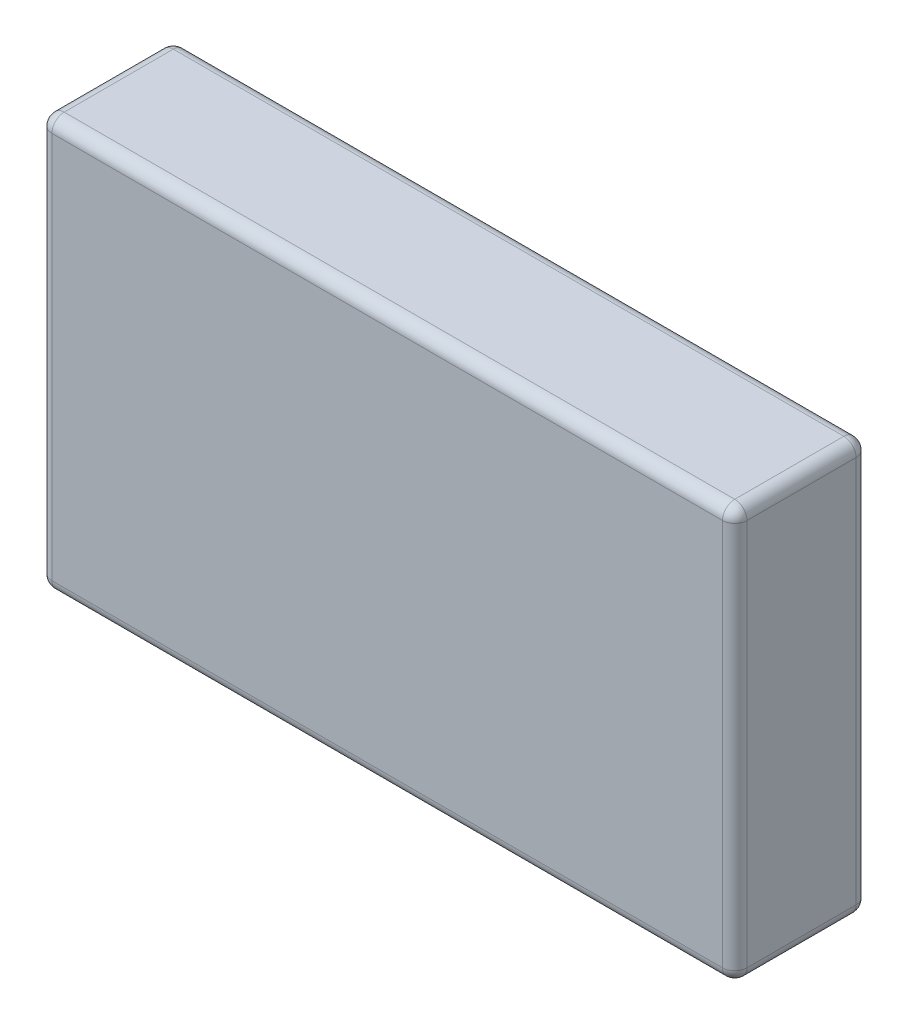
ISO-10303-21;
HEADER;
FILE_DESCRIPTION(('STEP AP214'),'2;1');
FILE_NAME('part.step','',(''),(''),'','','');
FILE_SCHEMA(('AUTOMOTIVE_DESIGN { 1 0 10303 214 1 1 1 1 }'));
ENDSEC;
DATA;
#1=APPLICATION_CONTEXT('core data for automotive mechanical design processes');
#2=APPLICATION_PROTOCOL_DEFINITION('international standard','automotive_design',2000,#1);
#3=PRODUCT_CONTEXT('',#1,'mechanical');
#4=PRODUCT('Part','Part','',(#3));
#5=PRODUCT_RELATED_PRODUCT_CATEGORY('part','',(#4));
#6=PRODUCT_DEFINITION_FORMATION('','',#4);
#7=PRODUCT_DEFINITION_CONTEXT('part definition',#1,'design');
#8=PRODUCT_DEFINITION('design','',#6,#7);
#9=PRODUCT_DEFINITION_SHAPE('','',#8);
#10=(LENGTH_UNIT() NAMED_UNIT(*) SI_UNIT(.MILLI.,.METRE.));
#11=(NAMED_UNIT(*) PLANE_ANGLE_UNIT() SI_UNIT($,.RADIAN.));
#12=(NAMED_UNIT(*) SI_UNIT($,.STERADIAN.) SOLID_ANGLE_UNIT());
#13=UNCERTAINTY_MEASURE_WITH_UNIT(LENGTH_MEASURE(1.E-05),#10,'distance_accuracy_value','');
#14=(GEOMETRIC_REPRESENTATION_CONTEXT(3) GLOBAL_UNCERTAINTY_ASSIGNED_CONTEXT((#13)) GLOBAL_UNIT_ASSIGNED_CONTEXT((#10,
#11,#12)) REPRESENTATION_CONTEXT('',''));
#15=CARTESIAN_POINT('',(0.,0.,0.));
#16=DIRECTION('',(0.,0.,1.));
#17=DIRECTION('',(1.,0.,0.));
#18=AXIS2_PLACEMENT_3D('',#15,#16,#17);
#19=CARTESIAN_POINT('',(-72.009,0.,-13.843));
#20=DIRECTION('',(-1.,0.,0.));
#21=DIRECTION('',(0.,1.,0.));
#22=AXIS2_PLACEMENT_3D('',#19,#20,#21);
#23=PLANE('',#22);
#24=DIRECTION('',(0.,-1.,0.));
#25=VECTOR('',#24,1.);
#26=CARTESIAN_POINT('',(-72.009,0.,11.303));
#27=LINE('',#26,#25);
#28=CARTESIAN_POINT('',(-72.009,82.804,11.303));
#29=VERTEX_POINT('',#28);
#30=CARTESIAN_POINT('',(-72.009,2.54,11.303));
#31=VERTEX_POINT('',#30);
#32=EDGE_CURVE('E169',#29,#31,#27,.T.);
#33=ORIENTED_EDGE('',*,*,#32,.F.);
#34=DIRECTION('',(0.,0.,1.));
#35=VECTOR('',#34,1.);
#36=CARTESIAN_POINT('',(-72.009,82.804,-6.9215));
#37=LINE('',#36,#35);
#38=CARTESIAN_POINT('',(-72.009,82.804,-11.303));
#39=VERTEX_POINT('',#38);
#40=EDGE_CURVE('E200',#39,#29,#37,.T.);
#41=ORIENTED_EDGE('',*,*,#40,.F.);
#42=DIRECTION('',(0.,1.,0.));
#43=VECTOR('',#42,1.);
#44=CARTESIAN_POINT('',(-72.009,0.,-11.303));
#45=LINE('',#44,#43);
#46=CARTESIAN_POINT('',(-72.009,2.54,-11.303));
#47=VERTEX_POINT('',#46);
#48=EDGE_CURVE('E20',#47,#39,#45,.T.);
#49=ORIENTED_EDGE('',*,*,#48,.F.);
#50=DIRECTION('',(0.,0.,-1.));
#51=VECTOR('',#50,1.);
#52=CARTESIAN_POINT('',(-72.009,2.54,-6.9215));
#53=LINE('',#52,#51);
#54=EDGE_CURVE('E161',#31,#47,#53,.T.);
#55=ORIENTED_EDGE('',*,*,#54,.F.);
#56=EDGE_LOOP('',(#33,#41,#49,#55));
#57=FACE_BOUND('',#56,.T.);
#58=ADVANCED_FACE('F16',(#57),#23,.T.);
#59=CARTESIAN_POINT('',(0.,85.344,0.));
#60=DIRECTION('',(0.,1.,0.));
#61=DIRECTION('',(1.,0.,0.));
#62=AXIS2_PLACEMENT_3D('',#59,#60,#61);
#63=PLANE('',#62);
#64=DIRECTION('',(0.,0.,1.));
#65=VECTOR('',#64,1.);
#66=CARTESIAN_POINT('',(69.469,85.344,6.9215));
#67=LINE('',#66,#65);
#68=CARTESIAN_POINT('',(69.469,85.344,-11.303));
#69=VERTEX_POINT('',#68);
#70=CARTESIAN_POINT('',(69.469,85.344,11.303));
#71=VERTEX_POINT('',#70);
#72=EDGE_CURVE('E254',#69,#71,#67,.T.);
#73=ORIENTED_EDGE('',*,*,#72,.F.);
#74=DIRECTION('',(1.,0.,0.));
#75=VECTOR('',#74,1.);
#76=CARTESIAN_POINT('',(36.0045,85.344,-11.303));
#77=LINE('',#76,#75);
#78=CARTESIAN_POINT('',(-69.469,85.344,-11.303));
#79=VERTEX_POINT('',#78);
#80=EDGE_CURVE('E123',#79,#69,#77,.T.);
#81=ORIENTED_EDGE('',*,*,#80,.F.);
#82=DIRECTION('',(0.,0.,-1.));
#83=VECTOR('',#82,1.);
#84=CARTESIAN_POINT('',(-69.469,85.344,-6.9215));
#85=LINE('',#84,#83);
#86=CARTESIAN_POINT('',(-69.469,85.344,11.303));
#87=VERTEX_POINT('',#86);
#88=EDGE_CURVE('E196',#87,#79,#85,.T.);
#89=ORIENTED_EDGE('',*,*,#88,.F.);
#90=DIRECTION('',(-1.,0.,0.));
#91=VECTOR('',#90,1.);
#92=CARTESIAN_POINT('',(-36.0045,85.344,11.303));
#93=LINE('',#92,#91);
#94=EDGE_CURVE('E188',#71,#87,#93,.T.);
#95=ORIENTED_EDGE('',*,*,#94,.F.);
#96=EDGE_LOOP('',(#73,#81,#89,#95));
#97=FACE_BOUND('',#96,.T.);
#98=ADVANCED_FACE('F355',(#97),#63,.T.);
#99=CARTESIAN_POINT('',(72.009,0.,13.843));
#100=DIRECTION('',(1.,0.,0.));
#101=DIRECTION('',(0.,0.,1.));
#102=AXIS2_PLACEMENT_3D('',#99,#100,#101);
#103=PLANE('',#102);
#104=DIRECTION('',(0.,1.,0.));
#105=VECTOR('',#104,1.);
#106=CARTESIAN_POINT('',(72.009,0.,11.303));
#107=LINE('',#106,#105);
#108=CARTESIAN_POINT('',(72.009,2.54,11.303));
#109=VERTEX_POINT('',#108);
#110=CARTESIAN_POINT('',(72.009,82.804,11.303));
#111=VERTEX_POINT('',#110);
#112=EDGE_CURVE('E258',#109,#111,#107,.T.);
#113=ORIENTED_EDGE('',*,*,#112,.F.);
#114=DIRECTION('',(0.,0.,1.));
#115=VECTOR('',#114,1.);
#116=CARTESIAN_POINT('',(72.009,2.54,6.9215));
#117=LINE('',#116,#115);
#118=CARTESIAN_POINT('',(72.009,2.54,-11.303));
#119=VERTEX_POINT('',#118);
#120=EDGE_CURVE('E10',#119,#109,#117,.T.);
#121=ORIENTED_EDGE('',*,*,#120,.F.);
#122=DIRECTION('',(0.,-1.,0.));
#123=VECTOR('',#122,1.);
#124=CARTESIAN_POINT('',(72.009,0.,-11.303));
#125=LINE('',#124,#123);
#126=CARTESIAN_POINT('',(72.009,82.804,-11.303));
#127=VERTEX_POINT('',#126);
#128=EDGE_CURVE('E235',#127,#119,#125,.T.);
#129=ORIENTED_EDGE('',*,*,#128,.F.);
#130=DIRECTION('',(0.,0.,-1.));
#131=VECTOR('',#130,1.);
#132=CARTESIAN_POINT('',(72.009,82.804,6.9215));
#133=LINE('',#132,#131);
#134=EDGE_CURVE('E257',#111,#127,#133,.T.);
#135=ORIENTED_EDGE('',*,*,#134,.F.);
#136=EDGE_LOOP('',(#113,#121,#129,#135));
#137=FACE_BOUND('',#136,.T.);
#138=ADVANCED_FACE('F18',(#137),#103,.T.);
#139=CARTESIAN_POINT('',(0.,0.,0.));
#140=DIRECTION('',(0.,1.,0.));
#141=DIRECTION('',(1.,0.,0.));
#142=AXIS2_PLACEMENT_3D('',#139,#140,#141);
#143=PLANE('',#142);
#144=DIRECTION('',(1.,0.,0.));
#145=VECTOR('',#144,1.);
#146=CARTESIAN_POINT('',(-36.0045,0.,11.303));
#147=LINE('',#146,#145);
#148=CARTESIAN_POINT('',(-69.469,0.,11.303));
#149=VERTEX_POINT('',#148);
#150=CARTESIAN_POINT('',(69.469,0.,11.303));
#151=VERTEX_POINT('',#150);
#152=EDGE_CURVE('E157',#149,#151,#147,.T.);
#153=ORIENTED_EDGE('',*,*,#152,.F.);
#154=DIRECTION('',(0.,0.,1.));
#155=VECTOR('',#154,1.);
#156=CARTESIAN_POINT('',(-69.469,0.,-6.9215));
#157=LINE('',#156,#155);
#158=CARTESIAN_POINT('',(-69.469,0.,-11.303));
#159=VERTEX_POINT('',#158);
#160=EDGE_CURVE('E122',#159,#149,#157,.T.);
#161=ORIENTED_EDGE('',*,*,#160,.F.);
#162=DIRECTION('',(-1.,0.,0.));
#163=VECTOR('',#162,1.);
#164=CARTESIAN_POINT('',(36.0045,0.,-11.303));
#165=LINE('',#164,#163);
#166=CARTESIAN_POINT('',(69.469,0.,-11.303));
#167=VERTEX_POINT('',#166);
#168=EDGE_CURVE('E174',#167,#159,#165,.T.);
#169=ORIENTED_EDGE('',*,*,#168,.F.);
#170=DIRECTION('',(0.,0.,-1.));
#171=VECTOR('',#170,1.);
#172=CARTESIAN_POINT('',(69.469,0.,6.9215));
#173=LINE('',#172,#171);
#174=EDGE_CURVE('E27',#151,#167,#173,.T.);
#175=ORIENTED_EDGE('',*,*,#174,.F.);
#176=EDGE_LOOP('',(#153,#161,#169,#175));
#177=FACE_BOUND('',#176,.T.);
#178=ADVANCED_FACE('F403',(#177),#143,.F.);
#179=CARTESIAN_POINT('',(-72.009,0.,13.843));
#180=DIRECTION('',(0.,0.,1.));
#181=DIRECTION('',(1.,0.,0.));
#182=AXIS2_PLACEMENT_3D('',#179,#180,#181);
#183=PLANE('',#182);
#184=DIRECTION('',(-1.,0.,0.));
#185=VECTOR('',#184,1.);
#186=CARTESIAN_POINT('',(-36.0045,2.54,13.843));
#187=LINE('',#186,#185);
#188=CARTESIAN_POINT('',(69.469,2.54,13.843));
#189=VERTEX_POINT('',#188);
#190=CARTESIAN_POINT('',(-69.469,2.54,13.843));
#191=VERTEX_POINT('',#190);
#192=EDGE_CURVE('E150',#189,#191,#187,.T.);
#193=ORIENTED_EDGE('',*,*,#192,.F.);
#194=DIRECTION('',(0.,-1.,0.));
#195=VECTOR('',#194,1.);
#196=CARTESIAN_POINT('',(69.469,0.,13.843));
#197=LINE('',#196,#195);
#198=CARTESIAN_POINT('',(69.469,82.804,13.843));
#199=VERTEX_POINT('',#198);
#200=EDGE_CURVE('E246',#199,#189,#197,.T.);
#201=ORIENTED_EDGE('',*,*,#200,.F.);
#202=DIRECTION('',(1.,0.,0.));
#203=VECTOR('',#202,1.);
#204=CARTESIAN_POINT('',(-36.0045,82.804,13.843));
#205=LINE('',#204,#203);
#206=CARTESIAN_POINT('',(-69.469,82.804,13.843));
#207=VERTEX_POINT('',#206);
#208=EDGE_CURVE('E41',#207,#199,#205,.T.);
#209=ORIENTED_EDGE('',*,*,#208,.F.);
#210=DIRECTION('',(0.,1.,0.));
#211=VECTOR('',#210,1.);
#212=CARTESIAN_POINT('',(-69.469,0.,13.843));
#213=LINE('',#212,#211);
#214=EDGE_CURVE('E185',#191,#207,#213,.T.);
#215=ORIENTED_EDGE('',*,*,#214,.F.);
#216=EDGE_LOOP('',(#193,#201,#209,#215));
#217=FACE_BOUND('',#216,.T.);
#218=ADVANCED_FACE('F479',(#217),#183,.T.);
#219=CARTESIAN_POINT('',(72.009,0.,-13.843));
#220=DIRECTION('',(0.,0.,-1.));
#221=DIRECTION('',(0.,-1.,0.));
#222=AXIS2_PLACEMENT_3D('',#219,#220,#221);
#223=PLANE('',#222);
#224=DIRECTION('',(1.,0.,0.));
#225=VECTOR('',#224,1.);
#226=CARTESIAN_POINT('',(36.0045,2.54,-13.843));
#227=LINE('',#226,#225);
#228=CARTESIAN_POINT('',(-69.469,2.54,-13.843));
#229=VERTEX_POINT('',#228);
#230=CARTESIAN_POINT('',(69.469,2.54,-13.843));
#231=VERTEX_POINT('',#230);
#232=EDGE_CURVE('E131',#229,#231,#227,.T.);
#233=ORIENTED_EDGE('',*,*,#232,.F.);
#234=DIRECTION('',(0.,-1.,0.));
#235=VECTOR('',#234,1.);
#236=CARTESIAN_POINT('',(-69.469,0.,-13.843));
#237=LINE('',#236,#235);
#238=CARTESIAN_POINT('',(-69.469,82.804,-13.843));
#239=VERTEX_POINT('',#238);
#240=EDGE_CURVE('E127',#239,#229,#237,.T.);
#241=ORIENTED_EDGE('',*,*,#240,.F.);
#242=DIRECTION('',(-1.,0.,0.));
#243=VECTOR('',#242,1.);
#244=CARTESIAN_POINT('',(36.0045,82.804,-13.843));
#245=LINE('',#244,#243);
#246=CARTESIAN_POINT('',(69.469,82.804,-13.843));
#247=VERTEX_POINT('',#246);
#248=EDGE_CURVE('E110',#247,#239,#245,.T.);
#249=ORIENTED_EDGE('',*,*,#248,.F.);
#250=DIRECTION('',(0.,1.,0.));
#251=VECTOR('',#250,1.);
#252=CARTESIAN_POINT('',(69.469,0.,-13.843));
#253=LINE('',#252,#251);
#254=EDGE_CURVE('E238',#231,#247,#253,.T.);
#255=ORIENTED_EDGE('',*,*,#254,.F.);
#256=EDGE_LOOP('',(#233,#241,#249,#255));
#257=FACE_BOUND('',#256,.T.);
#258=ADVANCED_FACE('F129',(#257),#223,.T.);
#259=CARTESIAN_POINT('',(69.469,2.54,6.9215));
#260=DIRECTION('',(0.,0.,1.));
#261=DIRECTION('',(0.707106781186549,-0.707106781186546,0.));
#262=AXIS2_PLACEMENT_3D('',#259,#260,#261);
#263=CYLINDRICAL_SURFACE('',#262,2.54);
#264=CARTESIAN_POINT('',(69.469,2.54,11.303));
#265=DIRECTION('',(0.,0.,-1.));
#266=DIRECTION('',(1.,0.,0.));
#267=AXIS2_PLACEMENT_3D('',#264,#265,#266);
#268=CIRCLE('',#267,2.54);
#269=EDGE_CURVE('E205',#109,#151,#268,.T.);
#270=ORIENTED_EDGE('',*,*,#269,.T.);
#271=ORIENTED_EDGE('',*,*,#174,.T.);
#272=CARTESIAN_POINT('',(69.469,2.54,-11.303));
#273=DIRECTION('',(0.,0.,1.));
#274=DIRECTION('',(0.,-1.,0.));
#275=AXIS2_PLACEMENT_3D('',#272,#273,#274);
#276=CIRCLE('',#275,2.54);
#277=EDGE_CURVE('E247',#167,#119,#276,.T.);
#278=ORIENTED_EDGE('',*,*,#277,.T.);
#279=ORIENTED_EDGE('',*,*,#120,.T.);
#280=EDGE_LOOP('',(#270,#271,#278,#279));
#281=FACE_BOUND('',#280,.T.);
#282=ADVANCED_FACE('F398',(#281),#263,.T.);
#283=CARTESIAN_POINT('',(-69.469,2.54,-6.9215));
#284=DIRECTION('',(0.,0.,-1.));
#285=DIRECTION('',(-0.707106781186549,-0.707106781186546,0.));
#286=AXIS2_PLACEMENT_3D('',#283,#284,#285);
#287=CYLINDRICAL_SURFACE('',#286,2.54);
#288=CARTESIAN_POINT('',(-69.469,2.54,-11.303));
#289=DIRECTION('',(0.,0.,1.));
#290=DIRECTION('',(-1.,0.,0.));
#291=AXIS2_PLACEMENT_3D('',#288,#289,#290);
#292=CIRCLE('',#291,2.54);
#293=EDGE_CURVE('E231',#47,#159,#292,.T.);
#294=ORIENTED_EDGE('',*,*,#293,.T.);
#295=ORIENTED_EDGE('',*,*,#160,.T.);
#296=CARTESIAN_POINT('',(-69.469,2.54,11.303));
#297=DIRECTION('',(0.,0.,-1.));
#298=DIRECTION('',(0.,-1.,0.));
#299=AXIS2_PLACEMENT_3D('',#296,#297,#298);
#300=CIRCLE('',#299,2.54);
#301=EDGE_CURVE('E227',#149,#31,#300,.T.);
#302=ORIENTED_EDGE('',*,*,#301,.T.);
#303=ORIENTED_EDGE('',*,*,#54,.T.);
#304=EDGE_LOOP('',(#294,#295,#302,#303));
#305=FACE_BOUND('',#304,.T.);
#306=ADVANCED_FACE('F409',(#305),#287,.T.);
#307=CARTESIAN_POINT('',(36.0045,82.804,-11.303));
#308=DIRECTION('',(-1.,0.,0.));
#309=DIRECTION('',(0.,0.707106781186544,-0.707106781186551));
#310=AXIS2_PLACEMENT_3D('',#307,#308,#309);
#311=CYLINDRICAL_SURFACE('',#310,2.54);
#312=CARTESIAN_POINT('',(-69.469,82.804,-11.303));
#313=DIRECTION('',(1.,0.,0.));
#314=DIRECTION('',(0.,0.,-1.));
#315=AXIS2_PLACEMENT_3D('',#312,#313,#314);
#316=CIRCLE('',#315,2.54);
#317=EDGE_CURVE('E115',#239,#79,#316,.T.);
#318=ORIENTED_EDGE('',*,*,#317,.T.);
#319=ORIENTED_EDGE('',*,*,#80,.T.);
#320=CARTESIAN_POINT('',(69.469,82.804,-11.303));
#321=DIRECTION('',(-1.,0.,0.));
#322=DIRECTION('',(0.,1.,0.));
#323=AXIS2_PLACEMENT_3D('',#320,#321,#322);
#324=CIRCLE('',#323,2.54);
#325=EDGE_CURVE('E117',#69,#247,#324,.T.);
#326=ORIENTED_EDGE('',*,*,#325,.T.);
#327=ORIENTED_EDGE('',*,*,#248,.T.);
#328=EDGE_LOOP('',(#318,#319,#326,#327));
#329=FACE_BOUND('',#328,.T.);
#330=ADVANCED_FACE('F112',(#329),#311,.T.);
#331=CARTESIAN_POINT('',(-69.469,82.804,-6.9215));
#332=DIRECTION('',(0.,0.,1.));
#333=DIRECTION('',(-0.707106781186552,0.707106781186543,0.));
#334=AXIS2_PLACEMENT_3D('',#331,#332,#333);
#335=CYLINDRICAL_SURFACE('',#334,2.54);
#336=CARTESIAN_POINT('',(-69.469,82.804,11.303));
#337=DIRECTION('',(0.,0.,-1.));
#338=DIRECTION('',(-1.,0.,0.));
#339=AXIS2_PLACEMENT_3D('',#336,#337,#338);
#340=CIRCLE('',#339,2.54);
#341=EDGE_CURVE('E266',#29,#87,#340,.T.);
#342=ORIENTED_EDGE('',*,*,#341,.T.);
#343=ORIENTED_EDGE('',*,*,#88,.T.);
#344=CARTESIAN_POINT('',(-69.469,82.804,-11.303));
#345=DIRECTION('',(0.,0.,1.));
#346=DIRECTION('',(0.,1.,0.));
#347=AXIS2_PLACEMENT_3D('',#344,#345,#346);
#348=CIRCLE('',#347,2.54);
#349=EDGE_CURVE('E136',#79,#39,#348,.T.);
#350=ORIENTED_EDGE('',*,*,#349,.T.);
#351=ORIENTED_EDGE('',*,*,#40,.T.);
#352=EDGE_LOOP('',(#342,#343,#350,#351));
#353=FACE_BOUND('',#352,.T.);
#354=ADVANCED_FACE('F366',(#353),#335,.T.);
#355=CARTESIAN_POINT('',(-36.0045,82.804,11.303));
#356=DIRECTION('',(1.,0.,0.));
#357=DIRECTION('',(0.,0.707106781186544,0.707106781186551));
#358=AXIS2_PLACEMENT_3D('',#355,#356,#357);
#359=CYLINDRICAL_SURFACE('',#358,2.54);
#360=CARTESIAN_POINT('',(69.469,82.804,11.303));
#361=DIRECTION('',(-1.,0.,0.));
#362=DIRECTION('',(0.,0.,1.));
#363=AXIS2_PLACEMENT_3D('',#360,#361,#362);
#364=CIRCLE('',#363,2.54);
#365=EDGE_CURVE('E184',#199,#71,#364,.T.);
#366=ORIENTED_EDGE('',*,*,#365,.T.);
#367=ORIENTED_EDGE('',*,*,#94,.T.);
#368=CARTESIAN_POINT('',(-69.469,82.804,11.303));
#369=DIRECTION('',(1.,0.,0.));
#370=DIRECTION('',(0.,1.,0.));
#371=AXIS2_PLACEMENT_3D('',#368,#369,#370);
#372=CIRCLE('',#371,2.54);
#373=EDGE_CURVE('E165',#87,#207,#372,.T.);
#374=ORIENTED_EDGE('',*,*,#373,.T.);
#375=ORIENTED_EDGE('',*,*,#208,.T.);
#376=EDGE_LOOP('',(#366,#367,#374,#375));
#377=FACE_BOUND('',#376,.T.);
#378=ADVANCED_FACE('F358',(#377),#359,.T.);
#379=CARTESIAN_POINT('',(-69.469,0.,11.303));
#380=DIRECTION('',(0.,1.,0.));
#381=DIRECTION('',(-0.707106781186547,0.,0.707106781186548));
#382=AXIS2_PLACEMENT_3D('',#379,#380,#381);
#383=CYLINDRICAL_SURFACE('',#382,2.54);
#384=CARTESIAN_POINT('',(-69.469,82.804,11.303));
#385=DIRECTION('',(0.,-1.,0.));
#386=DIRECTION('',(0.,0.,1.));
#387=AXIS2_PLACEMENT_3D('',#384,#385,#386);
#388=CIRCLE('',#387,2.54);
#389=EDGE_CURVE('E170',#207,#29,#388,.T.);
#390=ORIENTED_EDGE('',*,*,#389,.T.);
#391=ORIENTED_EDGE('',*,*,#32,.T.);
#392=CARTESIAN_POINT('',(-69.469,2.54,11.303));
#393=DIRECTION('',(0.,1.,0.));
#394=DIRECTION('',(-1.,0.,0.));
#395=AXIS2_PLACEMENT_3D('',#392,#393,#394);
#396=CIRCLE('',#395,2.54);
#397=EDGE_CURVE('E192',#31,#191,#396,.T.);
#398=ORIENTED_EDGE('',*,*,#397,.T.);
#399=ORIENTED_EDGE('',*,*,#214,.T.);
#400=EDGE_LOOP('',(#390,#391,#398,#399));
#401=FACE_BOUND('',#400,.T.);
#402=ADVANCED_FACE('F374',(#401),#383,.T.);
#403=CARTESIAN_POINT('',(-69.469,82.804,11.303));
#404=DIRECTION('',(-0.408248290463864,0.408248290463864,-0.816496580927725));
#405=DIRECTION('',(-0.577350269189628,0.577350269189623,0.577350269189626));
#406=AXIS2_PLACEMENT_3D('',#403,#404,#405);
#407=SPHERICAL_SURFACE('',#406,2.54);
#408=ORIENTED_EDGE('',*,*,#341,.F.);
#409=ORIENTED_EDGE('',*,*,#389,.F.);
#410=ORIENTED_EDGE('',*,*,#373,.F.);
#411=EDGE_LOOP('',(#408,#409,#410));
#412=FACE_BOUND('',#411,.T.);
#413=ADVANCED_FACE('F363',(#412),#407,.T.);
#414=CARTESIAN_POINT('',(69.469,82.804,6.9215));
#415=DIRECTION('',(0.,0.,-1.));
#416=DIRECTION('',(0.707106781186552,0.707106781186543,0.));
#417=AXIS2_PLACEMENT_3D('',#414,#415,#416);
#418=CYLINDRICAL_SURFACE('',#417,2.54);
#419=CARTESIAN_POINT('',(69.469,82.804,-11.303));
#420=DIRECTION('',(0.,0.,1.));
#421=DIRECTION('',(1.,0.,0.));
#422=AXIS2_PLACEMENT_3D('',#419,#420,#421);
#423=CIRCLE('',#422,2.54);
#424=EDGE_CURVE('E208',#127,#69,#423,.T.);
#425=ORIENTED_EDGE('',*,*,#424,.T.);
#426=ORIENTED_EDGE('',*,*,#72,.T.);
#427=CARTESIAN_POINT('',(69.469,82.804,11.303));
#428=DIRECTION('',(0.,0.,-1.));
#429=DIRECTION('',(0.,1.,0.));
#430=AXIS2_PLACEMENT_3D('',#427,#428,#429);
#431=CIRCLE('',#430,2.54);
#432=EDGE_CURVE('E183',#71,#111,#431,.T.);
#433=ORIENTED_EDGE('',*,*,#432,.T.);
#434=ORIENTED_EDGE('',*,*,#134,.T.);
#435=EDGE_LOOP('',(#425,#426,#433,#434));
#436=FACE_BOUND('',#435,.T.);
#437=ADVANCED_FACE('F314',(#436),#418,.T.);
#438=CARTESIAN_POINT('',(69.469,0.,11.303));
#439=DIRECTION('',(0.,1.,0.));
#440=DIRECTION('',(0.707106781186549,0.,0.707106781186546));
#441=AXIS2_PLACEMENT_3D('',#438,#439,#440);
#442=CYLINDRICAL_SURFACE('',#441,2.54);
#443=CARTESIAN_POINT('',(69.469,82.804,11.303));
#444=DIRECTION('',(0.,-1.,0.));
#445=DIRECTION('',(1.,0.,0.));
#446=AXIS2_PLACEMENT_3D('',#443,#444,#445);
#447=CIRCLE('',#446,2.54);
#448=EDGE_CURVE('E179',#111,#199,#447,.T.);
#449=ORIENTED_EDGE('',*,*,#448,.T.);
#450=ORIENTED_EDGE('',*,*,#200,.T.);
#451=CARTESIAN_POINT('',(69.469,2.54,11.303));
#452=DIRECTION('',(0.,1.,0.));
#453=DIRECTION('',(0.,0.,1.));
#454=AXIS2_PLACEMENT_3D('',#451,#452,#453);
#455=CIRCLE('',#454,2.54);
#456=EDGE_CURVE('E173',#189,#109,#455,.T.);
#457=ORIENTED_EDGE('',*,*,#456,.T.);
#458=ORIENTED_EDGE('',*,*,#112,.T.);
#459=EDGE_LOOP('',(#449,#450,#457,#458));
#460=FACE_BOUND('',#459,.T.);
#461=ADVANCED_FACE('F576',(#460),#442,.T.);
#462=CARTESIAN_POINT('',(69.469,82.804,11.303));
#463=DIRECTION('',(0.408248290463863,0.408248290463863,-0.816496580927726));
#464=DIRECTION('',(0.577350269189626,0.577350269189626,0.577350269189625));
#465=AXIS2_PLACEMENT_3D('',#462,#463,#464);
#466=SPHERICAL_SURFACE('',#465,2.54);
#467=ORIENTED_EDGE('',*,*,#365,.F.);
#468=ORIENTED_EDGE('',*,*,#448,.F.);
#469=ORIENTED_EDGE('',*,*,#432,.F.);
#470=EDGE_LOOP('',(#467,#468,#469));
#471=FACE_BOUND('',#470,.T.);
#472=ADVANCED_FACE('F594',(#471),#466,.T.);
#473=CARTESIAN_POINT('',(-69.469,0.,-11.303));
#474=DIRECTION('',(0.,1.,0.));
#475=DIRECTION('',(-0.707106781186549,0.,-0.707106781186546));
#476=AXIS2_PLACEMENT_3D('',#473,#474,#475);
#477=CYLINDRICAL_SURFACE('',#476,2.54);
#478=CARTESIAN_POINT('',(-69.469,82.804,-11.303));
#479=DIRECTION('',(0.,-1.,0.));
#480=DIRECTION('',(-1.,0.,0.));
#481=AXIS2_PLACEMENT_3D('',#478,#479,#480);
#482=CIRCLE('',#481,2.54);
#483=EDGE_CURVE('E140',#39,#239,#482,.T.);
#484=ORIENTED_EDGE('',*,*,#483,.T.);
#485=ORIENTED_EDGE('',*,*,#240,.T.);
#486=CARTESIAN_POINT('',(-69.469,2.54,-11.303));
#487=DIRECTION('',(0.,1.,0.));
#488=DIRECTION('',(0.,0.,-1.));
#489=AXIS2_PLACEMENT_3D('',#486,#487,#488);
#490=CIRCLE('',#489,2.54);
#491=EDGE_CURVE('E201',#229,#47,#490,.T.);
#492=ORIENTED_EDGE('',*,*,#491,.T.);
#493=ORIENTED_EDGE('',*,*,#48,.T.);
#494=EDGE_LOOP('',(#484,#485,#492,#493));
#495=FACE_BOUND('',#494,.T.);
#496=ADVANCED_FACE('F141',(#495),#477,.T.);
#497=CARTESIAN_POINT('',(-69.469,82.804,-11.303));
#498=DIRECTION('',(0.408248290463864,-0.408248290463859,-0.816496580927728));
#499=DIRECTION('',(-0.577350269189626,0.577350269189626,-0.577350269189625));
#500=AXIS2_PLACEMENT_3D('',#497,#498,#499);
#501=SPHERICAL_SURFACE('',#500,2.54);
#502=ORIENTED_EDGE('',*,*,#317,.F.);
#503=ORIENTED_EDGE('',*,*,#483,.F.);
#504=ORIENTED_EDGE('',*,*,#349,.F.);
#505=EDGE_LOOP('',(#502,#503,#504));
#506=FACE_BOUND('',#505,.T.);
#507=ADVANCED_FACE('F148',(#506),#501,.T.);
#508=CARTESIAN_POINT('',(-36.0045,2.54,11.303));
#509=DIRECTION('',(-1.,0.,0.));
#510=DIRECTION('',(0.,-0.707106781186548,0.707106781186548));
#511=AXIS2_PLACEMENT_3D('',#508,#509,#510);
#512=CYLINDRICAL_SURFACE('',#511,2.54);
#513=CARTESIAN_POINT('',(-69.469,2.54,11.303));
#514=DIRECTION('',(1.,0.,0.));
#515=DIRECTION('',(0.,0.,1.));
#516=AXIS2_PLACEMENT_3D('',#513,#514,#515);
#517=CIRCLE('',#516,2.54);
#518=EDGE_CURVE('E294',#191,#149,#517,.T.);
#519=ORIENTED_EDGE('',*,*,#518,.T.);
#520=ORIENTED_EDGE('',*,*,#152,.T.);
#521=CARTESIAN_POINT('',(69.469,2.54,11.303));
#522=DIRECTION('',(-1.,0.,0.));
#523=DIRECTION('',(0.,-1.,0.));
#524=AXIS2_PLACEMENT_3D('',#521,#522,#523);
#525=CIRCLE('',#524,2.54);
#526=EDGE_CURVE('E178',#151,#189,#525,.T.);
#527=ORIENTED_EDGE('',*,*,#526,.T.);
#528=ORIENTED_EDGE('',*,*,#192,.T.);
#529=EDGE_LOOP('',(#519,#520,#527,#528));
#530=FACE_BOUND('',#529,.T.);
#531=ADVANCED_FACE('F537',(#530),#512,.T.);
#532=CARTESIAN_POINT('',(-69.469,2.54,11.303));
#533=DIRECTION('',(-0.408248290463864,-0.408248290463862,-0.816496580927726));
#534=DIRECTION('',(-0.577350269189627,-0.577350269189625,0.577350269189625));
#535=AXIS2_PLACEMENT_3D('',#532,#533,#534);
#536=SPHERICAL_SURFACE('',#535,2.54);
#537=ORIENTED_EDGE('',*,*,#301,.F.);
#538=ORIENTED_EDGE('',*,*,#518,.F.);
#539=ORIENTED_EDGE('',*,*,#397,.F.);
#540=EDGE_LOOP('',(#537,#538,#539));
#541=FACE_BOUND('',#540,.T.);
#542=ADVANCED_FACE('F457',(#541),#536,.T.);
#543=CARTESIAN_POINT('',(69.469,0.,-11.303));
#544=DIRECTION('',(0.,1.,0.));
#545=DIRECTION('',(0.707106781186549,0.,-0.707106781186546));
#546=AXIS2_PLACEMENT_3D('',#543,#544,#545);
#547=CYLINDRICAL_SURFACE('',#546,2.54);
#548=CARTESIAN_POINT('',(69.469,82.804,-11.303));
#549=DIRECTION('',(0.,-1.,0.));
#550=DIRECTION('',(0.,0.,-1.));
#551=AXIS2_PLACEMENT_3D('',#548,#549,#550);
#552=CIRCLE('',#551,2.54);
#553=EDGE_CURVE('E217',#247,#127,#552,.T.);
#554=ORIENTED_EDGE('',*,*,#553,.T.);
#555=ORIENTED_EDGE('',*,*,#128,.T.);
#556=CARTESIAN_POINT('',(69.469,2.54,-11.303));
#557=DIRECTION('',(0.,1.,0.));
#558=DIRECTION('',(1.,0.,0.));
#559=AXIS2_PLACEMENT_3D('',#556,#557,#558);
#560=CIRCLE('',#559,2.54);
#561=EDGE_CURVE('E250',#119,#231,#560,.T.);
#562=ORIENTED_EDGE('',*,*,#561,.T.);
#563=ORIENTED_EDGE('',*,*,#254,.T.);
#564=EDGE_LOOP('',(#554,#555,#562,#563));
#565=FACE_BOUND('',#564,.T.);
#566=ADVANCED_FACE('F310',(#565),#547,.T.);
#567=CARTESIAN_POINT('',(69.469,82.804,-11.303));
#568=DIRECTION('',(-0.408248290463864,-0.40824829046386,-0.816496580927727));
#569=DIRECTION('',(0.577350269189631,0.577350269189622,-0.577350269189624));
#570=AXIS2_PLACEMENT_3D('',#567,#568,#569);
#571=SPHERICAL_SURFACE('',#570,2.54);
#572=ORIENTED_EDGE('',*,*,#424,.F.);
#573=ORIENTED_EDGE('',*,*,#553,.F.);
#574=ORIENTED_EDGE('',*,*,#325,.F.);
#575=EDGE_LOOP('',(#572,#573,#574));
#576=FACE_BOUND('',#575,.T.);
#577=ADVANCED_FACE('F313',(#576),#571,.T.);
#578=CARTESIAN_POINT('',(69.469,2.54,11.303));
#579=DIRECTION('',(0.408248290463864,-0.408248290463862,-0.816496580927726));
#580=DIRECTION('',(0.577350269189627,-0.577350269189625,0.577350269189625));
#581=AXIS2_PLACEMENT_3D('',#578,#579,#580);
#582=SPHERICAL_SURFACE('',#581,2.54);
#583=ORIENTED_EDGE('',*,*,#456,.F.);
#584=ORIENTED_EDGE('',*,*,#526,.F.);
#585=ORIENTED_EDGE('',*,*,#269,.F.);
#586=EDGE_LOOP('',(#583,#584,#585));
#587=FACE_BOUND('',#586,.T.);
#588=ADVANCED_FACE('F514',(#587),#582,.T.);
#589=CARTESIAN_POINT('',(36.0045,2.54,-11.303));
#590=DIRECTION('',(1.,0.,0.));
#591=DIRECTION('',(0.,-0.707106781186548,-0.707106781186548));
#592=AXIS2_PLACEMENT_3D('',#589,#590,#591);
#593=CYLINDRICAL_SURFACE('',#592,2.54);
#594=CARTESIAN_POINT('',(69.469,2.54,-11.303));
#595=DIRECTION('',(-1.,0.,0.));
#596=DIRECTION('',(0.,0.,-1.));
#597=AXIS2_PLACEMENT_3D('',#594,#595,#596);
#598=CIRCLE('',#597,2.54);
#599=EDGE_CURVE('E204',#231,#167,#598,.T.);
#600=ORIENTED_EDGE('',*,*,#599,.T.);
#601=ORIENTED_EDGE('',*,*,#168,.T.);
#602=CARTESIAN_POINT('',(-69.469,2.54,-11.303));
#603=DIRECTION('',(1.,0.,0.));
#604=DIRECTION('',(0.,-1.,0.));
#605=AXIS2_PLACEMENT_3D('',#602,#603,#604);
#606=CIRCLE('',#605,2.54);
#607=EDGE_CURVE('E203',#159,#229,#606,.T.);
#608=ORIENTED_EDGE('',*,*,#607,.T.);
#609=ORIENTED_EDGE('',*,*,#232,.T.);
#610=EDGE_LOOP('',(#600,#601,#608,#609));
#611=FACE_BOUND('',#610,.T.);
#612=ADVANCED_FACE('F392',(#611),#593,.T.);
#613=CARTESIAN_POINT('',(-69.469,2.54,-11.303));
#614=DIRECTION('',(0.408248290463864,-0.816496580927725,0.408248290463864));
#615=DIRECTION('',(-0.577350269189623,-0.577350269189627,-0.577350269189627));
#616=AXIS2_PLACEMENT_3D('',#613,#614,#615);
#617=SPHERICAL_SURFACE('',#616,2.54);
#618=ORIENTED_EDGE('',*,*,#491,.F.);
#619=ORIENTED_EDGE('',*,*,#607,.F.);
#620=ORIENTED_EDGE('',*,*,#293,.F.);
#621=EDGE_LOOP('',(#618,#619,#620));
#622=FACE_BOUND('',#621,.T.);
#623=ADVANCED_FACE('F415',(#622),#617,.T.);
#624=CARTESIAN_POINT('',(69.469,2.54,-11.303));
#625=DIRECTION('',(-0.816496580927727,-0.408248290463862,-0.408248290463862));
#626=DIRECTION('',(0.577350269189627,-0.577350269189626,-0.577350269189625));
#627=AXIS2_PLACEMENT_3D('',#624,#625,#626);
#628=SPHERICAL_SURFACE('',#627,2.54);
#629=ORIENTED_EDGE('',*,*,#561,.F.);
#630=ORIENTED_EDGE('',*,*,#277,.F.);
#631=ORIENTED_EDGE('',*,*,#599,.F.);
#632=EDGE_LOOP('',(#629,#630,#631));
#633=FACE_BOUND('',#632,.T.);
#634=ADVANCED_FACE('F397',(#633),#628,.T.);
#635=CLOSED_SHELL('',(#58,#98,#138,#178,#218,#258,#282,#306,#330,#354,#378,#402,#413,#437,#461,
#472,#496,#507,#531,#542,#566,#577,#588,#612,#623,#634));
#636=MANIFOLD_SOLID_BREP('B1',#635);
#637=ADVANCED_BREP_SHAPE_REPRESENTATION('',(#18,#636),#14);
#638=SHAPE_DEFINITION_REPRESENTATION(#9,#637);
ENDSEC;
END-ISO-10303-21;
